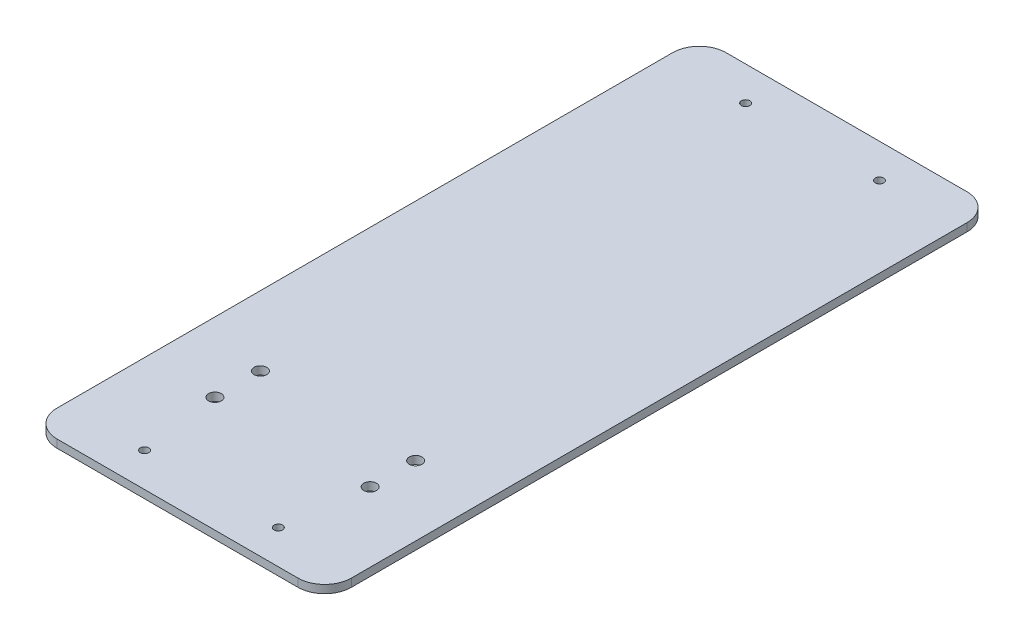
ISO-10303-21;
HEADER;
FILE_DESCRIPTION(('STEP AP214'),'2;1');
FILE_NAME('part.step','',(''),(''),'','','');
FILE_SCHEMA(('AUTOMOTIVE_DESIGN { 1 0 10303 214 1 1 1 1 }'));
ENDSEC;
DATA;
#1=APPLICATION_CONTEXT('core data for automotive mechanical design processes');
#2=APPLICATION_PROTOCOL_DEFINITION('international standard','automotive_design',2000,#1);
#3=PRODUCT_CONTEXT('',#1,'mechanical');
#4=PRODUCT('Part','Part','',(#3));
#5=PRODUCT_RELATED_PRODUCT_CATEGORY('part','',(#4));
#6=PRODUCT_DEFINITION_FORMATION('','',#4);
#7=PRODUCT_DEFINITION_CONTEXT('part definition',#1,'design');
#8=PRODUCT_DEFINITION('design','',#6,#7);
#9=PRODUCT_DEFINITION_SHAPE('','',#8);
#10=(LENGTH_UNIT() NAMED_UNIT(*) SI_UNIT(.MILLI.,.METRE.));
#11=(NAMED_UNIT(*) PLANE_ANGLE_UNIT() SI_UNIT($,.RADIAN.));
#12=(NAMED_UNIT(*) SI_UNIT($,.STERADIAN.) SOLID_ANGLE_UNIT());
#13=UNCERTAINTY_MEASURE_WITH_UNIT(LENGTH_MEASURE(1.E-05),#10,'distance_accuracy_value','');
#14=(GEOMETRIC_REPRESENTATION_CONTEXT(3) GLOBAL_UNCERTAINTY_ASSIGNED_CONTEXT((#13)) GLOBAL_UNIT_ASSIGNED_CONTEXT((#10,
#11,#12)) REPRESENTATION_CONTEXT('',''));
#15=CARTESIAN_POINT('',(0.,0.,0.));
#16=DIRECTION('',(0.,0.,1.));
#17=DIRECTION('',(1.,0.,0.));
#18=AXIS2_PLACEMENT_3D('',#15,#16,#17);
#19=CARTESIAN_POINT('',(100.,3.,-10.));
#20=DIRECTION('',(0.,-1.,0.));
#21=DIRECTION('',(0.,0.,-1.));
#22=AXIS2_PLACEMENT_3D('',#19,#20,#21);
#23=CYLINDRICAL_SURFACE('',#22,10.);
#24=CARTESIAN_POINT('',(100.,0.,-10.));
#25=DIRECTION('',(0.,1.,0.));
#26=DIRECTION('',(0.,0.,1.));
#27=AXIS2_PLACEMENT_3D('',#24,#25,#26);
#28=CIRCLE('',#27,10.);
#29=CARTESIAN_POINT('',(100.,0.,0.));
#30=VERTEX_POINT('',#29);
#31=CARTESIAN_POINT('',(110.,0.,-10.));
#32=VERTEX_POINT('',#31);
#33=EDGE_CURVE('E142',#30,#32,#28,.T.);
#34=ORIENTED_EDGE('',*,*,#33,.T.);
#35=DIRECTION('',(0.,-1.,0.));
#36=VECTOR('',#35,1.);
#37=CARTESIAN_POINT('',(110.,3.,-10.));
#38=LINE('',#37,#36);
#39=CARTESIAN_POINT('',(110.,3.,-10.));
#40=VERTEX_POINT('',#39);
#41=EDGE_CURVE('E11',#40,#32,#38,.T.);
#42=ORIENTED_EDGE('',*,*,#41,.F.);
#43=CARTESIAN_POINT('',(100.,3.,-10.));
#44=DIRECTION('',(0.,1.,0.));
#45=DIRECTION('',(0.,0.,1.));
#46=AXIS2_PLACEMENT_3D('',#43,#44,#45);
#47=CIRCLE('',#46,10.);
#48=CARTESIAN_POINT('',(100.,3.,0.));
#49=VERTEX_POINT('',#48);
#50=EDGE_CURVE('E157',#49,#40,#47,.T.);
#51=ORIENTED_EDGE('',*,*,#50,.F.);
#52=DIRECTION('',(0.,-1.,0.));
#53=VECTOR('',#52,1.);
#54=CARTESIAN_POINT('',(100.,3.,0.));
#55=LINE('',#54,#53);
#56=EDGE_CURVE('E138',#49,#30,#55,.T.);
#57=ORIENTED_EDGE('',*,*,#56,.T.);
#58=EDGE_LOOP('',(#34,#42,#51,#57));
#59=FACE_BOUND('',#58,.T.);
#60=ADVANCED_FACE('F44',(#59),#23,.T.);
#61=CARTESIAN_POINT('',(110.,3.,-10.));
#62=DIRECTION('',(-1.,0.,0.));
#63=DIRECTION('',(0.,0.,1.));
#64=AXIS2_PLACEMENT_3D('',#61,#62,#63);
#65=PLANE('',#64);
#66=DIRECTION('',(0.,0.,-1.));
#67=VECTOR('',#66,1.);
#68=CARTESIAN_POINT('',(110.,0.,-10.));
#69=LINE('',#68,#67);
#70=CARTESIAN_POINT('',(110.,0.,-240.));
#71=VERTEX_POINT('',#70);
#72=EDGE_CURVE('E145',#32,#71,#69,.T.);
#73=ORIENTED_EDGE('',*,*,#72,.T.);
#74=DIRECTION('',(0.,-1.,0.));
#75=VECTOR('',#74,1.);
#76=CARTESIAN_POINT('',(110.,3.,-240.));
#77=LINE('',#76,#75);
#78=CARTESIAN_POINT('',(110.,3.,-240.));
#79=VERTEX_POINT('',#78);
#80=EDGE_CURVE('E53',#79,#71,#77,.T.);
#81=ORIENTED_EDGE('',*,*,#80,.F.);
#82=DIRECTION('',(0.,0.,-1.));
#83=VECTOR('',#82,1.);
#84=CARTESIAN_POINT('',(110.,3.,-10.));
#85=LINE('',#84,#83);
#86=EDGE_CURVE('E105',#40,#79,#85,.T.);
#87=ORIENTED_EDGE('',*,*,#86,.F.);
#88=ORIENTED_EDGE('',*,*,#41,.T.);
#89=EDGE_LOOP('',(#73,#81,#87,#88));
#90=FACE_BOUND('',#89,.T.);
#91=ADVANCED_FACE('F244',(#90),#65,.F.);
#92=CARTESIAN_POINT('',(100.,3.,-240.));
#93=DIRECTION('',(0.,-1.,0.));
#94=DIRECTION('',(0.,0.,-1.));
#95=AXIS2_PLACEMENT_3D('',#92,#93,#94);
#96=CYLINDRICAL_SURFACE('',#95,10.);
#97=CARTESIAN_POINT('',(100.,0.,-240.));
#98=DIRECTION('',(0.,1.,0.));
#99=DIRECTION('',(0.,0.,-1.));
#100=AXIS2_PLACEMENT_3D('',#97,#98,#99);
#101=CIRCLE('',#100,10.);
#102=CARTESIAN_POINT('',(100.,0.,-250.));
#103=VERTEX_POINT('',#102);
#104=EDGE_CURVE('E148',#71,#103,#101,.T.);
#105=ORIENTED_EDGE('',*,*,#104,.T.);
#106=DIRECTION('',(0.,-1.,0.));
#107=VECTOR('',#106,1.);
#108=CARTESIAN_POINT('',(100.,3.,-250.));
#109=LINE('',#108,#107);
#110=CARTESIAN_POINT('',(100.,3.,-250.));
#111=VERTEX_POINT('',#110);
#112=EDGE_CURVE('E164',#111,#103,#109,.T.);
#113=ORIENTED_EDGE('',*,*,#112,.F.);
#114=CARTESIAN_POINT('',(100.,3.,-240.));
#115=DIRECTION('',(0.,1.,0.));
#116=DIRECTION('',(0.,0.,-1.));
#117=AXIS2_PLACEMENT_3D('',#114,#115,#116);
#118=CIRCLE('',#117,10.);
#119=EDGE_CURVE('E212',#79,#111,#118,.T.);
#120=ORIENTED_EDGE('',*,*,#119,.F.);
#121=ORIENTED_EDGE('',*,*,#80,.T.);
#122=EDGE_LOOP('',(#105,#113,#120,#121));
#123=FACE_BOUND('',#122,.T.);
#124=ADVANCED_FACE('F248',(#123),#96,.T.);
#125=CARTESIAN_POINT('',(10.,3.,-250.));
#126=DIRECTION('',(0.,0.,1.));
#127=DIRECTION('',(1.,0.,0.));
#128=AXIS2_PLACEMENT_3D('',#125,#126,#127);
#129=PLANE('',#128);
#130=DIRECTION('',(-1.,0.,0.));
#131=VECTOR('',#130,1.);
#132=CARTESIAN_POINT('',(10.,0.,-250.));
#133=LINE('',#132,#131);
#134=CARTESIAN_POINT('',(10.,0.,-250.));
#135=VERTEX_POINT('',#134);
#136=EDGE_CURVE('E150',#103,#135,#133,.T.);
#137=ORIENTED_EDGE('',*,*,#136,.T.);
#138=DIRECTION('',(0.,-1.,0.));
#139=VECTOR('',#138,1.);
#140=CARTESIAN_POINT('',(10.,3.,-250.));
#141=LINE('',#140,#139);
#142=CARTESIAN_POINT('',(10.,3.,-250.));
#143=VERTEX_POINT('',#142);
#144=EDGE_CURVE('E161',#143,#135,#141,.T.);
#145=ORIENTED_EDGE('',*,*,#144,.F.);
#146=DIRECTION('',(-1.,0.,0.));
#147=VECTOR('',#146,1.);
#148=CARTESIAN_POINT('',(10.,3.,-250.));
#149=LINE('',#148,#147);
#150=EDGE_CURVE('E214',#111,#143,#149,.T.);
#151=ORIENTED_EDGE('',*,*,#150,.F.);
#152=ORIENTED_EDGE('',*,*,#112,.T.);
#153=EDGE_LOOP('',(#137,#145,#151,#152));
#154=FACE_BOUND('',#153,.T.);
#155=ADVANCED_FACE('F220',(#154),#129,.F.);
#156=CARTESIAN_POINT('',(10.,3.,-240.));
#157=DIRECTION('',(0.,-1.,0.));
#158=DIRECTION('',(0.,0.,-1.));
#159=AXIS2_PLACEMENT_3D('',#156,#157,#158);
#160=CYLINDRICAL_SURFACE('',#159,10.);
#161=CARTESIAN_POINT('',(10.,0.,-240.));
#162=DIRECTION('',(0.,1.,0.));
#163=DIRECTION('',(0.,0.,-1.));
#164=AXIS2_PLACEMENT_3D('',#161,#162,#163);
#165=CIRCLE('',#164,10.);
#166=CARTESIAN_POINT('',(0.,0.,-240.));
#167=VERTEX_POINT('',#166);
#168=EDGE_CURVE('E152',#135,#167,#165,.T.);
#169=ORIENTED_EDGE('',*,*,#168,.T.);
#170=DIRECTION('',(0.,-1.,0.));
#171=VECTOR('',#170,1.);
#172=CARTESIAN_POINT('',(0.,3.,-240.));
#173=LINE('',#172,#171);
#174=CARTESIAN_POINT('',(0.,3.,-240.));
#175=VERTEX_POINT('',#174);
#176=EDGE_CURVE('E133',#175,#167,#173,.T.);
#177=ORIENTED_EDGE('',*,*,#176,.F.);
#178=CARTESIAN_POINT('',(10.,3.,-240.));
#179=DIRECTION('',(0.,1.,0.));
#180=DIRECTION('',(0.,0.,-1.));
#181=AXIS2_PLACEMENT_3D('',#178,#179,#180);
#182=CIRCLE('',#181,10.);
#183=EDGE_CURVE('E124',#143,#175,#182,.T.);
#184=ORIENTED_EDGE('',*,*,#183,.F.);
#185=ORIENTED_EDGE('',*,*,#144,.T.);
#186=EDGE_LOOP('',(#169,#177,#184,#185));
#187=FACE_BOUND('',#186,.T.);
#188=ADVANCED_FACE('F224',(#187),#160,.T.);
#189=CARTESIAN_POINT('',(0.,3.,-10.0000000000001));
#190=DIRECTION('',(1.,0.,0.));
#191=DIRECTION('',(0.,0.,-1.));
#192=AXIS2_PLACEMENT_3D('',#189,#190,#191);
#193=PLANE('',#192);
#194=DIRECTION('',(0.,0.,1.));
#195=VECTOR('',#194,1.);
#196=CARTESIAN_POINT('',(0.,0.,-10.0000000000001));
#197=LINE('',#196,#195);
#198=CARTESIAN_POINT('',(0.,0.,-10.0000000000001));
#199=VERTEX_POINT('',#198);
#200=EDGE_CURVE('E132',#167,#199,#197,.T.);
#201=ORIENTED_EDGE('',*,*,#200,.T.);
#202=DIRECTION('',(0.,-1.,0.));
#203=VECTOR('',#202,1.);
#204=CARTESIAN_POINT('',(0.,3.,-10.0000000000001));
#205=LINE('',#204,#203);
#206=CARTESIAN_POINT('',(0.,3.,-10.0000000000001));
#207=VERTEX_POINT('',#206);
#208=EDGE_CURVE('E129',#207,#199,#205,.T.);
#209=ORIENTED_EDGE('',*,*,#208,.F.);
#210=DIRECTION('',(0.,0.,1.));
#211=VECTOR('',#210,1.);
#212=CARTESIAN_POINT('',(0.,3.,-10.0000000000001));
#213=LINE('',#212,#211);
#214=EDGE_CURVE('E118',#175,#207,#213,.T.);
#215=ORIENTED_EDGE('',*,*,#214,.F.);
#216=ORIENTED_EDGE('',*,*,#176,.T.);
#217=EDGE_LOOP('',(#201,#209,#215,#216));
#218=FACE_BOUND('',#217,.T.);
#219=ADVANCED_FACE('F130',(#218),#193,.F.);
#220=CARTESIAN_POINT('',(10.,3.,-10.));
#221=DIRECTION('',(0.,-1.,0.));
#222=DIRECTION('',(0.,0.,-1.));
#223=AXIS2_PLACEMENT_3D('',#220,#221,#222);
#224=CYLINDRICAL_SURFACE('',#223,10.);
#225=CARTESIAN_POINT('',(10.,0.,-10.));
#226=DIRECTION('',(0.,1.,0.));
#227=DIRECTION('',(0.,0.,-1.));
#228=AXIS2_PLACEMENT_3D('',#225,#226,#227);
#229=CIRCLE('',#228,10.);
#230=CARTESIAN_POINT('',(10.0000000000001,0.,0.));
#231=VERTEX_POINT('',#230);
#232=EDGE_CURVE('E91',#199,#231,#229,.T.);
#233=ORIENTED_EDGE('',*,*,#232,.T.);
#234=DIRECTION('',(0.,-1.,0.));
#235=VECTOR('',#234,1.);
#236=CARTESIAN_POINT('',(10.0000000000001,3.,0.));
#237=LINE('',#236,#235);
#238=CARTESIAN_POINT('',(10.0000000000001,3.,0.));
#239=VERTEX_POINT('',#238);
#240=EDGE_CURVE('E134',#239,#231,#237,.T.);
#241=ORIENTED_EDGE('',*,*,#240,.F.);
#242=CARTESIAN_POINT('',(10.,3.,-10.));
#243=DIRECTION('',(0.,1.,0.));
#244=DIRECTION('',(0.,0.,-1.));
#245=AXIS2_PLACEMENT_3D('',#242,#243,#244);
#246=CIRCLE('',#245,10.);
#247=EDGE_CURVE('E122',#207,#239,#246,.T.);
#248=ORIENTED_EDGE('',*,*,#247,.F.);
#249=ORIENTED_EDGE('',*,*,#208,.T.);
#250=EDGE_LOOP('',(#233,#241,#248,#249));
#251=FACE_BOUND('',#250,.T.);
#252=ADVANCED_FACE('F136',(#251),#224,.T.);
#253=CARTESIAN_POINT('',(10.0000000000001,3.,0.));
#254=DIRECTION('',(0.,0.,-1.));
#255=DIRECTION('',(-1.,0.,0.));
#256=AXIS2_PLACEMENT_3D('',#253,#254,#255);
#257=PLANE('',#256);
#258=DIRECTION('',(1.,0.,0.));
#259=VECTOR('',#258,1.);
#260=CARTESIAN_POINT('',(10.0000000000001,0.,0.));
#261=LINE('',#260,#259);
#262=EDGE_CURVE('E97',#231,#30,#261,.T.);
#263=ORIENTED_EDGE('',*,*,#262,.T.);
#264=ORIENTED_EDGE('',*,*,#56,.F.);
#265=DIRECTION('',(1.,0.,0.));
#266=VECTOR('',#265,1.);
#267=CARTESIAN_POINT('',(10.0000000000001,3.,0.));
#268=LINE('',#267,#266);
#269=EDGE_CURVE('E62',#239,#49,#268,.T.);
#270=ORIENTED_EDGE('',*,*,#269,.F.);
#271=ORIENTED_EDGE('',*,*,#240,.T.);
#272=EDGE_LOOP('',(#263,#264,#270,#271));
#273=FACE_BOUND('',#272,.T.);
#274=ADVANCED_FACE('F232',(#273),#257,.F.);
#275=CARTESIAN_POINT('',(100.,3.,-10.));
#276=DIRECTION('',(0.,1.,0.));
#277=DIRECTION('',(0.,0.,1.));
#278=AXIS2_PLACEMENT_3D('',#275,#276,#277);
#279=PLANE('',#278);
#280=CARTESIAN_POINT('',(84.,3.,-60.));
#281=DIRECTION('',(0.,1.,0.));
#282=DIRECTION('',(0.,0.,1.));
#283=AXIS2_PLACEMENT_3D('',#280,#281,#282);
#284=CIRCLE('',#283,2.38125);
#285=CARTESIAN_POINT('',(84.,3.,-57.61875));
#286=VERTEX_POINT('',#285);
#287=EDGE_CURVE('E371',#286,#286,#284,.T.);
#288=ORIENTED_EDGE('',*,*,#287,.F.);
#289=EDGE_LOOP('',(#288));
#290=FACE_BOUND('',#289,.T.);
#291=CARTESIAN_POINT('',(26.,3.,-43.));
#292=DIRECTION('',(0.,1.,0.));
#293=DIRECTION('',(0.,0.,1.));
#294=AXIS2_PLACEMENT_3D('',#291,#292,#293);
#295=CIRCLE('',#294,2.38125);
#296=CARTESIAN_POINT('',(26.,3.,-40.61875));
#297=VERTEX_POINT('',#296);
#298=EDGE_CURVE('E372',#297,#297,#295,.T.);
#299=ORIENTED_EDGE('',*,*,#298,.F.);
#300=EDGE_LOOP('',(#299));
#301=FACE_BOUND('',#300,.T.);
#302=CARTESIAN_POINT('',(84.,3.,-43.));
#303=DIRECTION('',(0.,1.,0.));
#304=DIRECTION('',(0.,0.,1.));
#305=AXIS2_PLACEMENT_3D('',#302,#303,#304);
#306=CIRCLE('',#305,2.38125);
#307=CARTESIAN_POINT('',(84.,3.,-40.61875));
#308=VERTEX_POINT('',#307);
#309=EDGE_CURVE('E376',#308,#308,#306,.T.);
#310=ORIENTED_EDGE('',*,*,#309,.F.);
#311=EDGE_LOOP('',(#310));
#312=FACE_BOUND('',#311,.T.);
#313=CARTESIAN_POINT('',(26.,3.,-60.));
#314=DIRECTION('',(0.,1.,0.));
#315=DIRECTION('',(0.,0.,1.));
#316=AXIS2_PLACEMENT_3D('',#313,#314,#315);
#317=CIRCLE('',#316,2.38125);
#318=CARTESIAN_POINT('',(26.,3.,-57.61875));
#319=VERTEX_POINT('',#318);
#320=EDGE_CURVE('E185',#319,#319,#317,.T.);
#321=ORIENTED_EDGE('',*,*,#320,.F.);
#322=EDGE_LOOP('',(#321));
#323=FACE_BOUND('',#322,.T.);
#324=CARTESIAN_POINT('',(80.,3.,-237.3));
#325=DIRECTION('',(0.,1.,0.));
#326=DIRECTION('',(0.,0.,1.));
#327=AXIS2_PLACEMENT_3D('',#324,#325,#326);
#328=CIRCLE('',#327,1.5875);
#329=CARTESIAN_POINT('',(80.,3.,-235.7125));
#330=VERTEX_POINT('',#329);
#331=EDGE_CURVE('E201',#330,#330,#328,.T.);
#332=ORIENTED_EDGE('',*,*,#331,.F.);
#333=EDGE_LOOP('',(#332));
#334=FACE_BOUND('',#333,.T.);
#335=CARTESIAN_POINT('',(30.,3.,-12.7));
#336=DIRECTION('',(0.,1.,0.));
#337=DIRECTION('',(0.,0.,1.));
#338=AXIS2_PLACEMENT_3D('',#335,#336,#337);
#339=CIRCLE('',#338,1.5875);
#340=CARTESIAN_POINT('',(30.,3.,-11.1125));
#341=VERTEX_POINT('',#340);
#342=EDGE_CURVE('E196',#341,#341,#339,.T.);
#343=ORIENTED_EDGE('',*,*,#342,.F.);
#344=EDGE_LOOP('',(#343));
#345=FACE_BOUND('',#344,.T.);
#346=CARTESIAN_POINT('',(80.,3.,-12.7));
#347=DIRECTION('',(0.,1.,0.));
#348=DIRECTION('',(0.,0.,1.));
#349=AXIS2_PLACEMENT_3D('',#346,#347,#348);
#350=CIRCLE('',#349,1.5875);
#351=CARTESIAN_POINT('',(80.,3.,-11.1125));
#352=VERTEX_POINT('',#351);
#353=EDGE_CURVE('E192',#352,#352,#350,.T.);
#354=ORIENTED_EDGE('',*,*,#353,.F.);
#355=EDGE_LOOP('',(#354));
#356=FACE_BOUND('',#355,.T.);
#357=CARTESIAN_POINT('',(30.,3.,-237.3));
#358=DIRECTION('',(0.,1.,0.));
#359=DIRECTION('',(0.,0.,1.));
#360=AXIS2_PLACEMENT_3D('',#357,#358,#359);
#361=CIRCLE('',#360,1.5875);
#362=CARTESIAN_POINT('',(30.,3.,-235.7125));
#363=VERTEX_POINT('',#362);
#364=EDGE_CURVE('E173',#363,#363,#361,.T.);
#365=ORIENTED_EDGE('',*,*,#364,.F.);
#366=EDGE_LOOP('',(#365));
#367=FACE_BOUND('',#366,.T.);
#368=ORIENTED_EDGE('',*,*,#50,.T.);
#369=ORIENTED_EDGE('',*,*,#86,.T.);
#370=ORIENTED_EDGE('',*,*,#119,.T.);
#371=ORIENTED_EDGE('',*,*,#150,.T.);
#372=ORIENTED_EDGE('',*,*,#183,.T.);
#373=ORIENTED_EDGE('',*,*,#214,.T.);
#374=ORIENTED_EDGE('',*,*,#247,.T.);
#375=ORIENTED_EDGE('',*,*,#269,.T.);
#376=EDGE_LOOP('',(#368,#369,#370,#371,#372,#373,#374,#375));
#377=FACE_BOUND('',#376,.T.);
#378=ADVANCED_FACE('F120',(#290,#301,#312,#323,#334,#345,#356,#367,#377),#279,.T.);
#379=CARTESIAN_POINT('',(100.,0.,-10.));
#380=DIRECTION('',(0.,1.,0.));
#381=DIRECTION('',(0.,0.,1.));
#382=AXIS2_PLACEMENT_3D('',#379,#380,#381);
#383=PLANE('',#382);
#384=CARTESIAN_POINT('',(84.,0.,-60.));
#385=DIRECTION('',(0.,1.,0.));
#386=DIRECTION('',(0.,0.,1.));
#387=AXIS2_PLACEMENT_3D('',#384,#385,#386);
#388=CIRCLE('',#387,2.38125);
#389=CARTESIAN_POINT('',(84.,0.,-57.61875));
#390=VERTEX_POINT('',#389);
#391=EDGE_CURVE('E47',#390,#390,#388,.T.);
#392=ORIENTED_EDGE('',*,*,#391,.T.);
#393=EDGE_LOOP('',(#392));
#394=FACE_BOUND('',#393,.T.);
#395=CARTESIAN_POINT('',(26.,0.,-43.));
#396=DIRECTION('',(0.,1.,0.));
#397=DIRECTION('',(0.,0.,1.));
#398=AXIS2_PLACEMENT_3D('',#395,#396,#397);
#399=CIRCLE('',#398,2.38125);
#400=CARTESIAN_POINT('',(26.,0.,-40.61875));
#401=VERTEX_POINT('',#400);
#402=EDGE_CURVE('E187',#401,#401,#399,.T.);
#403=ORIENTED_EDGE('',*,*,#402,.T.);
#404=EDGE_LOOP('',(#403));
#405=FACE_BOUND('',#404,.T.);
#406=CARTESIAN_POINT('',(84.,0.,-43.));
#407=DIRECTION('',(0.,1.,0.));
#408=DIRECTION('',(0.,0.,1.));
#409=AXIS2_PLACEMENT_3D('',#406,#407,#408);
#410=CIRCLE('',#409,2.38125);
#411=CARTESIAN_POINT('',(84.,0.,-40.61875));
#412=VERTEX_POINT('',#411);
#413=EDGE_CURVE('E184',#412,#412,#410,.T.);
#414=ORIENTED_EDGE('',*,*,#413,.T.);
#415=EDGE_LOOP('',(#414));
#416=FACE_BOUND('',#415,.T.);
#417=CARTESIAN_POINT('',(26.,0.,-60.));
#418=DIRECTION('',(0.,1.,0.));
#419=DIRECTION('',(0.,0.,1.));
#420=AXIS2_PLACEMENT_3D('',#417,#418,#419);
#421=CIRCLE('',#420,2.38125);
#422=CARTESIAN_POINT('',(26.,0.,-57.61875));
#423=VERTEX_POINT('',#422);
#424=EDGE_CURVE('E181',#423,#423,#421,.T.);
#425=ORIENTED_EDGE('',*,*,#424,.T.);
#426=EDGE_LOOP('',(#425));
#427=FACE_BOUND('',#426,.T.);
#428=CARTESIAN_POINT('',(80.,0.,-237.3));
#429=DIRECTION('',(0.,1.,0.));
#430=DIRECTION('',(0.,0.,1.));
#431=AXIS2_PLACEMENT_3D('',#428,#429,#430);
#432=CIRCLE('',#431,1.5875);
#433=CARTESIAN_POINT('',(80.,0.,-235.7125));
#434=VERTEX_POINT('',#433);
#435=EDGE_CURVE('E146',#434,#434,#432,.T.);
#436=ORIENTED_EDGE('',*,*,#435,.T.);
#437=EDGE_LOOP('',(#436));
#438=FACE_BOUND('',#437,.T.);
#439=CARTESIAN_POINT('',(30.,0.,-12.7));
#440=DIRECTION('',(0.,1.,0.));
#441=DIRECTION('',(0.,0.,1.));
#442=AXIS2_PLACEMENT_3D('',#439,#440,#441);
#443=CIRCLE('',#442,1.5875);
#444=CARTESIAN_POINT('',(30.,0.,-11.1125));
#445=VERTEX_POINT('',#444);
#446=EDGE_CURVE('E176',#445,#445,#443,.T.);
#447=ORIENTED_EDGE('',*,*,#446,.T.);
#448=EDGE_LOOP('',(#447));
#449=FACE_BOUND('',#448,.T.);
#450=CARTESIAN_POINT('',(80.,0.,-12.7));
#451=DIRECTION('',(0.,1.,0.));
#452=DIRECTION('',(0.,0.,1.));
#453=AXIS2_PLACEMENT_3D('',#450,#451,#452);
#454=CIRCLE('',#453,1.5875);
#455=CARTESIAN_POINT('',(80.,0.,-11.1125));
#456=VERTEX_POINT('',#455);
#457=EDGE_CURVE('E172',#456,#456,#454,.T.);
#458=ORIENTED_EDGE('',*,*,#457,.T.);
#459=EDGE_LOOP('',(#458));
#460=FACE_BOUND('',#459,.T.);
#461=CARTESIAN_POINT('',(30.,0.,-237.3));
#462=DIRECTION('',(0.,1.,0.));
#463=DIRECTION('',(0.,0.,1.));
#464=AXIS2_PLACEMENT_3D('',#461,#462,#463);
#465=CIRCLE('',#464,1.5875);
#466=CARTESIAN_POINT('',(30.,0.,-235.7125));
#467=VERTEX_POINT('',#466);
#468=EDGE_CURVE('E169',#467,#467,#465,.T.);
#469=ORIENTED_EDGE('',*,*,#468,.T.);
#470=EDGE_LOOP('',(#469));
#471=FACE_BOUND('',#470,.T.);
#472=ORIENTED_EDGE('',*,*,#33,.F.);
#473=ORIENTED_EDGE('',*,*,#262,.F.);
#474=ORIENTED_EDGE('',*,*,#232,.F.);
#475=ORIENTED_EDGE('',*,*,#200,.F.);
#476=ORIENTED_EDGE('',*,*,#168,.F.);
#477=ORIENTED_EDGE('',*,*,#136,.F.);
#478=ORIENTED_EDGE('',*,*,#104,.F.);
#479=ORIENTED_EDGE('',*,*,#72,.F.);
#480=EDGE_LOOP('',(#472,#473,#474,#475,#476,#477,#478,#479));
#481=FACE_BOUND('',#480,.T.);
#482=ADVANCED_FACE('F227',(#394,#405,#416,#427,#438,#449,#460,#471,#481),#383,.F.);
#483=CARTESIAN_POINT('',(30.,-17.,-237.3));
#484=DIRECTION('',(0.,1.,0.));
#485=DIRECTION('',(0.,0.,1.));
#486=AXIS2_PLACEMENT_3D('',#483,#484,#485);
#487=CYLINDRICAL_SURFACE('',#486,1.5875);
#488=ORIENTED_EDGE('',*,*,#364,.T.);
#489=EDGE_LOOP('',(#488));
#490=FACE_BOUND('',#489,.T.);
#491=ORIENTED_EDGE('',*,*,#468,.F.);
#492=EDGE_LOOP('',(#491));
#493=FACE_BOUND('',#492,.T.);
#494=ADVANCED_FACE('F278',(#490,#493),#487,.F.);
#495=CARTESIAN_POINT('',(80.,-17.,-12.7));
#496=DIRECTION('',(0.,1.,0.));
#497=DIRECTION('',(0.,0.,1.));
#498=AXIS2_PLACEMENT_3D('',#495,#496,#497);
#499=CYLINDRICAL_SURFACE('',#498,1.5875);
#500=ORIENTED_EDGE('',*,*,#353,.T.);
#501=EDGE_LOOP('',(#500));
#502=FACE_BOUND('',#501,.T.);
#503=ORIENTED_EDGE('',*,*,#457,.F.);
#504=EDGE_LOOP('',(#503));
#505=FACE_BOUND('',#504,.T.);
#506=ADVANCED_FACE('F283',(#502,#505),#499,.F.);
#507=CARTESIAN_POINT('',(30.,-17.,-12.7));
#508=DIRECTION('',(0.,1.,0.));
#509=DIRECTION('',(0.,0.,1.));
#510=AXIS2_PLACEMENT_3D('',#507,#508,#509);
#511=CYLINDRICAL_SURFACE('',#510,1.5875);
#512=ORIENTED_EDGE('',*,*,#342,.T.);
#513=EDGE_LOOP('',(#512));
#514=FACE_BOUND('',#513,.T.);
#515=ORIENTED_EDGE('',*,*,#446,.F.);
#516=EDGE_LOOP('',(#515));
#517=FACE_BOUND('',#516,.T.);
#518=ADVANCED_FACE('F295',(#514,#517),#511,.F.);
#519=CARTESIAN_POINT('',(80.,-17.,-237.3));
#520=DIRECTION('',(0.,1.,0.));
#521=DIRECTION('',(0.,0.,1.));
#522=AXIS2_PLACEMENT_3D('',#519,#520,#521);
#523=CYLINDRICAL_SURFACE('',#522,1.5875);
#524=ORIENTED_EDGE('',*,*,#331,.T.);
#525=EDGE_LOOP('',(#524));
#526=FACE_BOUND('',#525,.T.);
#527=ORIENTED_EDGE('',*,*,#435,.F.);
#528=EDGE_LOOP('',(#527));
#529=FACE_BOUND('',#528,.T.);
#530=ADVANCED_FACE('F304',(#526,#529),#523,.F.);
#531=CARTESIAN_POINT('',(26.,-7.,-60.));
#532=DIRECTION('',(0.,1.,0.));
#533=DIRECTION('',(0.,0.,1.));
#534=AXIS2_PLACEMENT_3D('',#531,#532,#533);
#535=CYLINDRICAL_SURFACE('',#534,2.38125);
#536=ORIENTED_EDGE('',*,*,#320,.T.);
#537=EDGE_LOOP('',(#536));
#538=FACE_BOUND('',#537,.T.);
#539=ORIENTED_EDGE('',*,*,#424,.F.);
#540=EDGE_LOOP('',(#539));
#541=FACE_BOUND('',#540,.T.);
#542=ADVANCED_FACE('F314',(#538,#541),#535,.F.);
#543=CARTESIAN_POINT('',(84.,-7.,-43.));
#544=DIRECTION('',(0.,1.,0.));
#545=DIRECTION('',(0.,0.,1.));
#546=AXIS2_PLACEMENT_3D('',#543,#544,#545);
#547=CYLINDRICAL_SURFACE('',#546,2.38125);
#548=ORIENTED_EDGE('',*,*,#309,.T.);
#549=EDGE_LOOP('',(#548));
#550=FACE_BOUND('',#549,.T.);
#551=ORIENTED_EDGE('',*,*,#413,.F.);
#552=EDGE_LOOP('',(#551));
#553=FACE_BOUND('',#552,.T.);
#554=ADVANCED_FACE('F334',(#550,#553),#547,.F.);
#555=CARTESIAN_POINT('',(26.,-7.,-43.));
#556=DIRECTION('',(0.,1.,0.));
#557=DIRECTION('',(0.,0.,1.));
#558=AXIS2_PLACEMENT_3D('',#555,#556,#557);
#559=CYLINDRICAL_SURFACE('',#558,2.38125);
#560=ORIENTED_EDGE('',*,*,#298,.T.);
#561=EDGE_LOOP('',(#560));
#562=FACE_BOUND('',#561,.T.);
#563=ORIENTED_EDGE('',*,*,#402,.F.);
#564=EDGE_LOOP('',(#563));
#565=FACE_BOUND('',#564,.T.);
#566=ADVANCED_FACE('F344',(#562,#565),#559,.F.);
#567=CARTESIAN_POINT('',(84.,-7.,-60.));
#568=DIRECTION('',(0.,1.,0.));
#569=DIRECTION('',(0.,0.,1.));
#570=AXIS2_PLACEMENT_3D('',#567,#568,#569);
#571=CYLINDRICAL_SURFACE('',#570,2.38125);
#572=ORIENTED_EDGE('',*,*,#287,.T.);
#573=EDGE_LOOP('',(#572));
#574=FACE_BOUND('',#573,.T.);
#575=ORIENTED_EDGE('',*,*,#391,.F.);
#576=EDGE_LOOP('',(#575));
#577=FACE_BOUND('',#576,.T.);
#578=ADVANCED_FACE('F354',(#574,#577),#571,.F.);
#579=CLOSED_SHELL('',(#60,#91,#124,#155,#188,#219,#252,#274,#378,#482,#494,#506,#518,#530,#542,
#554,#566,#578));
#580=MANIFOLD_SOLID_BREP('B2',#579);
#581=ADVANCED_BREP_SHAPE_REPRESENTATION('',(#18,#580),#14);
#582=SHAPE_DEFINITION_REPRESENTATION(#9,#581);
ENDSEC;
END-ISO-10303-21;
